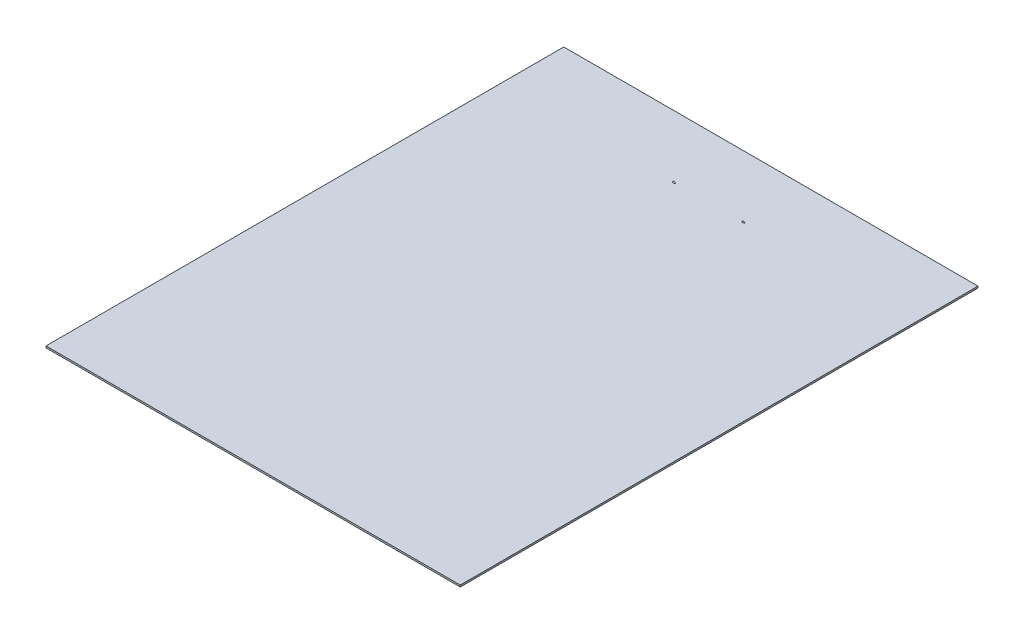
ISO-10303-21;
HEADER;
FILE_DESCRIPTION(('STEP AP214'),'2;1');
FILE_NAME('part.step','',(''),(''),'','','');
FILE_SCHEMA(('AUTOMOTIVE_DESIGN { 1 0 10303 214 1 1 1 1 }'));
ENDSEC;
DATA;
#1=APPLICATION_CONTEXT('core data for automotive mechanical design processes');
#2=APPLICATION_PROTOCOL_DEFINITION('international standard','automotive_design',2000,#1);
#3=PRODUCT_CONTEXT('',#1,'mechanical');
#4=PRODUCT('Part','Part','',(#3));
#5=PRODUCT_RELATED_PRODUCT_CATEGORY('part','',(#4));
#6=PRODUCT_DEFINITION_FORMATION('','',#4);
#7=PRODUCT_DEFINITION_CONTEXT('part definition',#1,'design');
#8=PRODUCT_DEFINITION('design','',#6,#7);
#9=PRODUCT_DEFINITION_SHAPE('','',#8);
#10=(LENGTH_UNIT() NAMED_UNIT(*) SI_UNIT(.MILLI.,.METRE.));
#11=(NAMED_UNIT(*) PLANE_ANGLE_UNIT() SI_UNIT($,.RADIAN.));
#12=(NAMED_UNIT(*) SI_UNIT($,.STERADIAN.) SOLID_ANGLE_UNIT());
#13=UNCERTAINTY_MEASURE_WITH_UNIT(LENGTH_MEASURE(1.E-05),#10,'distance_accuracy_value','');
#14=(GEOMETRIC_REPRESENTATION_CONTEXT(3) GLOBAL_UNCERTAINTY_ASSIGNED_CONTEXT((#13)) GLOBAL_UNIT_ASSIGNED_CONTEXT((#10,
#11,#12)) REPRESENTATION_CONTEXT('',''));
#15=CARTESIAN_POINT('',(0.,0.,0.));
#16=DIRECTION('',(0.,0.,1.));
#17=DIRECTION('',(1.,0.,0.));
#18=AXIS2_PLACEMENT_3D('',#15,#16,#17);
#19=CARTESIAN_POINT('',(0.,0.5,0.));
#20=DIRECTION('',(0.,1.,0.));
#21=DIRECTION('',(0.,0.,1.));
#22=AXIS2_PLACEMENT_3D('',#19,#20,#21);
#23=PLANE('',#22);
#24=DIRECTION('',(0.,0.,-1.));
#25=VECTOR('',#24,1.);
#26=CARTESIAN_POINT('',(60.,0.5,-75.));
#27=LINE('',#26,#25);
#28=CARTESIAN_POINT('',(60.,0.5,75.));
#29=VERTEX_POINT('',#28);
#30=CARTESIAN_POINT('',(60.,0.5,-75.));
#31=VERTEX_POINT('',#30);
#32=EDGE_CURVE('E203',#29,#31,#27,.T.);
#33=ORIENTED_EDGE('',*,*,#32,.T.);
#34=DIRECTION('',(-1.,0.,0.));
#35=VECTOR('',#34,1.);
#36=CARTESIAN_POINT('',(-60.,0.5,-75.));
#37=LINE('',#36,#35);
#38=CARTESIAN_POINT('',(-60.,0.5,-75.));
#39=VERTEX_POINT('',#38);
#40=EDGE_CURVE('E206',#31,#39,#37,.T.);
#41=ORIENTED_EDGE('',*,*,#40,.T.);
#42=DIRECTION('',(0.,0.,1.));
#43=VECTOR('',#42,1.);
#44=CARTESIAN_POINT('',(-60.,0.5,-75.));
#45=LINE('',#44,#43);
#46=CARTESIAN_POINT('',(-60.,0.5,75.));
#47=VERTEX_POINT('',#46);
#48=EDGE_CURVE('E209',#39,#47,#45,.T.);
#49=ORIENTED_EDGE('',*,*,#48,.T.);
#50=DIRECTION('',(1.,0.,0.));
#51=VECTOR('',#50,1.);
#52=CARTESIAN_POINT('',(-60.,0.5,75.));
#53=LINE('',#52,#51);
#54=EDGE_CURVE('E211',#47,#29,#53,.T.);
#55=ORIENTED_EDGE('',*,*,#54,.T.);
#56=EDGE_LOOP('',(#33,#41,#49,#55));
#57=FACE_BOUND('',#56,.T.);
#58=CARTESIAN_POINT('',(-10.460975361802,0.5,-56.9749657072999));
#59=CARTESIAN_POINT('',(-10.4469960564302,0.499999999999999,-56.9547853966699));
#60=CARTESIAN_POINT('',(-10.4312210534308,0.5,-56.9360040411659));
#61=CARTESIAN_POINT('',(-10.3968843461404,0.5,-56.9014101155262));
#62=CARTESIAN_POINT('',(-10.3783411094096,0.500000000000001,-56.8855793267481));
#63=CARTESIAN_POINT('',(-10.3095587228234,0.499999999999996,-56.8351615931186));
#64=CARTESIAN_POINT('',(-10.2535816912959,0.49999999999998,-56.808160111834));
#65=CARTESIAN_POINT('',(-10.1657068433425,0.500000000000009,-56.7807565432656));
#66=CARTESIAN_POINT('',(-10.1354799763858,0.500000000000028,-56.7738037008125));
#67=CARTESIAN_POINT('',(-10.0743173035873,0.499999999999972,-56.7642248890738));
#68=CARTESIAN_POINT('',(-10.0433817892298,0.499999999999896,-56.7615971720441));
#69=CARTESIAN_POINT('',(-9.97600383370771,0.499999999999885,-56.7605651015174));
#70=CARTESIAN_POINT('',(-9.93954619677301,0.499999999999976,-56.7629813883405));
#71=CARTESIAN_POINT('',(-9.86754999083501,0.500000000000024,-56.7737559004484));
#72=CARTESIAN_POINT('',(-9.83201214477104,0.499999999999982,-56.7821186608645));
#73=CARTESIAN_POINT('',(-9.73988282963522,0.500000000000029,-56.812715791551));
#74=CARTESIAN_POINT('',(-9.6848349095989,0.500000000000224,-56.840458044681));
#75=CARTESIAN_POINT('',(-9.61790887989959,0.499999999999914,-56.8911654210405));
#76=CARTESIAN_POINT('',(-9.60021472466478,0.499999999999764,-56.9066803283989));
#77=CARTESIAN_POINT('',(-9.56740112215454,0.500000000000238,-56.9404074809614));
#78=CARTESIAN_POINT('',(-9.55229867630448,0.500000000000867,-56.9586361737685));
#79=CARTESIAN_POINT('',(-9.53886289045487,0.500000000002345,-56.9781467119231));
#80=B_SPLINE_CURVE_WITH_KNOTS('',3,(#58,#59,#60,#61,#62,#63,#64,#65,#66,#67,#68,#69,#70,#71,#72,
#73,#74,#75,#76,#77,#78,#79),.UNSPECIFIED.,.F.,.F.,(4,2,2,2,2,2,2,2,2,2,4),(0.,
0.0733361284396542,0.146203236250548,0.32862516227278,0.421484741874623,0.514306788537526,
0.623392144644421,0.732560785029745,0.913605776793868,0.983955993558317,1.05475138991327),.UNSPECIFIED.);
#81=CARTESIAN_POINT('',(-10.460975361802,0.5,-56.9749657072999));
#82=VERTEX_POINT('',#81);
#83=CARTESIAN_POINT('',(-9.53886289045423,0.5,-56.9781467119232));
#84=VERTEX_POINT('',#83);
#85=EDGE_CURVE('E191',#82,#84,#80,.T.);
#86=ORIENTED_EDGE('',*,*,#85,.F.);
#87=DIRECTION('',(0.999994049863389,0.,-0.00344967213201496));
#88=VECTOR('',#87,1.);
#89=CARTESIAN_POINT('',(-0.19666827004829,0.5,-57.0103744121163));
#90=LINE('',#89,#88);
#91=EDGE_CURVE('E199',#82,#84,#90,.T.);
#92=ORIENTED_EDGE('',*,*,#91,.T.);
#93=EDGE_LOOP('',(#86,#92));
#94=FACE_BOUND('',#93,.T.);
#95=CARTESIAN_POINT('',(9.53533638430643,0.5,-57.043946837035));
#96=CARTESIAN_POINT('',(9.54899701388712,0.499999999999997,-57.0236065895948));
#97=CARTESIAN_POINT('',(9.56448871434286,0.499999999999999,-57.0046524420506));
#98=CARTESIAN_POINT('',(9.59831335376148,0.500000000000002,-56.9697016104425));
#99=CARTESIAN_POINT('',(9.61662673032592,0.500000000000003,-56.9536861124682));
#100=CARTESIAN_POINT('',(9.68439397182631,0.499999999999994,-56.9028176801136));
#101=CARTESIAN_POINT('',(9.7396156890533,0.499999999999962,-56.8754208475064));
#102=CARTESIAN_POINT('',(9.82647679590136,0.500000000000017,-56.8472225943228));
#103=CARTESIAN_POINT('',(9.856392792651,0.500000000000054,-56.83996757891));
#104=CARTESIAN_POINT('',(9.91697496579769,0.499999999999946,-56.8297174266323));
#105=CARTESIAN_POINT('',(9.94764080240037,0.499999999999802,-56.8267203953376));
#106=CARTESIAN_POINT('',(10.0147000793734,0.500000000000072,-56.824797487041));
#107=CARTESIAN_POINT('',(10.05112018358,0.500000000000592,-56.8267118194214));
#108=CARTESIAN_POINT('',(10.1231379622962,0.499999999999407,-56.8364385669432));
#109=CARTESIAN_POINT('',(10.1587348777571,0.499999999997701,-56.8442562181534));
#110=CARTESIAN_POINT('',(10.2519408224626,0.500000000003862,-56.8735614766857));
#111=CARTESIAN_POINT('',(10.3080526008458,0.500000000019033,-56.9007304017142));
#112=CARTESIAN_POINT('',(10.3780785989086,0.499999999992018,-56.9520744888124));
#113=CARTESIAN_POINT('',(10.3975768801854,0.499999999978021,-56.9688283328592));
#114=CARTESIAN_POINT('',(10.4335268620098,0.500000000022152,-57.0055767932845));
#115=CARTESIAN_POINT('',(10.4499533864895,0.500000000080847,-57.025595869593));
#116=CARTESIAN_POINT('',(10.4643493539241,0.500000000219077,-57.0471516463319));
#117=B_SPLINE_CURVE_WITH_KNOTS('',3,(#95,#96,#97,#98,#99,#100,#101,#102,#103,#104,#105,#106,
#107,#108,#109,#110,#111,#112,#113,#114,#115,#116),.UNSPECIFIED.,.F.,.F.,(4,2,2,2,2,2,2,2,2,2,
4),(0.,0.0731886425098684,0.145890986923088,0.326838927721385,0.419004004396445,
0.511128062828486,0.620018443554959,0.729005520432568,0.912126404008055,0.988921203629535,
1.06632019087317),.UNSPECIFIED.);
#118=CARTESIAN_POINT('',(9.53533638430643,0.5,-57.043946837035));
#119=VERTEX_POINT('',#118);
#120=CARTESIAN_POINT('',(10.464349353982,0.5,-57.0471516463424));
#121=VERTEX_POINT('',#120);
#122=EDGE_CURVE('E49',#119,#121,#117,.T.);
#123=ORIENTED_EDGE('',*,*,#122,.F.);
#124=DIRECTION('',(0.999994049863389,0.,-0.00344967213201496));
#125=VECTOR('',#124,1.);
#126=CARTESIAN_POINT('',(-0.19666827004829,0.5,-57.0103744121163));
#127=LINE('',#126,#125);
#128=EDGE_CURVE('E114',#119,#121,#127,.T.);
#129=ORIENTED_EDGE('',*,*,#128,.T.);
#130=EDGE_LOOP('',(#123,#129));
#131=FACE_BOUND('',#130,.T.);
#132=ADVANCED_FACE('F35',(#57,#94,#131),#23,.T.);
#133=CARTESIAN_POINT('',(0.,0.,0.));
#134=DIRECTION('',(0.,1.,0.));
#135=DIRECTION('',(0.,0.,1.));
#136=AXIS2_PLACEMENT_3D('',#133,#134,#135);
#137=PLANE('',#136);
#138=DIRECTION('',(0.999994049863389,0.,-0.00344967213201496));
#139=VECTOR('',#138,1.);
#140=CARTESIAN_POINT('',(-0.196830017791452,0.,-57.0572619928922));
#141=LINE('',#140,#139);
#142=CARTESIAN_POINT('',(-10.4611371095458,0.,-57.0218532880767));
#143=VERTEX_POINT('',#142);
#144=CARTESIAN_POINT('',(-9.53902463819674,0.,-57.0250342926982));
#145=VERTEX_POINT('',#144);
#146=EDGE_CURVE('E153',#143,#145,#141,.T.);
#147=ORIENTED_EDGE('',*,*,#146,.F.);
#148=CARTESIAN_POINT('',(-10.4611371095464,0.,-57.0218532880758));
#149=CARTESIAN_POINT('',(-10.4679630092566,0.,-57.0116813427667));
#150=CARTESIAN_POINT('',(-10.4743320567019,0.,-57.0012082356502));
#151=CARTESIAN_POINT('',(-10.4860684394223,0.,-56.9797007070301));
#152=CARTESIAN_POINT('',(-10.4914346379071,0.,-56.9686656663485));
#153=CARTESIAN_POINT('',(-10.505866608035,0.,-56.9348343559035));
#154=CARTESIAN_POINT('',(-10.5132779087052,0.,-56.9112940911387));
#155=CARTESIAN_POINT('',(-10.5223571457734,0.,-56.8664111386103));
#156=CARTESIAN_POINT('',(-10.5246592139517,0.,-56.8451940493644));
#157=CARTESIAN_POINT('',(-10.5252640777871,0.,-56.802741828253));
#158=CARTESIAN_POINT('',(-10.5235762181254,-3.04750728747226E-13,-56.7815068547539));
#159=CARTESIAN_POINT('',(-10.5166525969999,2.75766327867578E-13,-56.7416590795495));
#160=CARTESIAN_POINT('',(-10.5117590991299,9.86118051421637E-13,-56.7229852973622));
#161=CARTESIAN_POINT('',(-10.4990231552442,-9.87536373846247E-13,-56.6866500841177));
#162=CARTESIAN_POINT('',(-10.491176477913,-3.67642605863797E-12,-56.6689901477437));
#163=CARTESIAN_POINT('',(-10.4725231502204,-3.81624808433177E-12,-56.6343791740182));
#164=CARTESIAN_POINT('',(-10.4616087590495,-1.04891149582623E-12,-56.6174864903724));
#165=CARTESIAN_POINT('',(-10.4374333986551,1.0507752594639E-12,-56.5854600561116));
#166=CARTESIAN_POINT('',(-10.4241682943618,3.77013216371385E-13,-56.5703294841993));
#167=CARTESIAN_POINT('',(-10.3774236651341,-8.61513865742952E-13,-56.5237592980868));
#168=CARTESIAN_POINT('',(-10.3398504035154,-1.76589524780187E-13,-56.4963109334364));
#169=CARTESIAN_POINT('',(-10.2754670173048,1.0595343073926E-13,-56.4607792841041));
#170=CARTESIAN_POINT('',(-10.2503485194683,0.,-56.4493397243013));
#171=CARTESIAN_POINT('',(-10.1987574925318,0.,-56.430045228941));
#172=CARTESIAN_POINT('',(-10.1722840586414,0.,-56.4221927243911));
#173=CARTESIAN_POINT('',(-10.081288902465,0.,-56.4016019040462));
#174=CARTESIAN_POINT('',(-10.0146795070416,0.,-56.3970768960555));
#175=CARTESIAN_POINT('',(-9.9125587365966,0.,-56.4053072731835));
#176=CARTESIAN_POINT('',(-9.87629961169109,0.,-56.4113161694524));
#177=CARTESIAN_POINT('',(-9.80531696869056,0.,-56.4295604466599));
#178=CARTESIAN_POINT('',(-9.77059227187014,0.,-56.4417909545843));
#179=CARTESIAN_POINT('',(-9.71188629956554,0.,-56.4690352658613));
#180=CARTESIAN_POINT('',(-9.68728925225827,0.,-56.4827330360665));
#181=CARTESIAN_POINT('',(-9.64064744839178,0.,-56.513923570098));
#182=CARTESIAN_POINT('',(-9.61859781075366,0.,-56.5314088852949));
#183=CARTESIAN_POINT('',(-9.58170414453953,0.,-56.5665887200221));
#184=CARTESIAN_POINT('',(-9.56627835420516,0.,-56.5836718207093));
#185=CARTESIAN_POINT('',(-9.53846652382989,0.,-56.6201143829363));
#186=CARTESIAN_POINT('',(-9.52607283322025,0.,-56.6394679290629));
#187=CARTESIAN_POINT('',(-9.50486471253764,0.,-56.6802892647052));
#188=CARTESIAN_POINT('',(-9.49608335934021,0.,-56.7017744495549));
#189=CARTESIAN_POINT('',(-9.48288631317772,0.,-56.7460331688076));
#190=CARTESIAN_POINT('',(-9.47846412954489,0.,-56.7688047342095));
#191=CARTESIAN_POINT('',(-9.47457988788737,0.,-56.8117602492291));
#192=CARTESIAN_POINT('',(-9.47454582799799,0.,-56.8318940628244));
#193=CARTESIAN_POINT('',(-9.47800892546718,0.,-56.8718836848981));
#194=CARTESIAN_POINT('',(-9.48151090739355,0.,-56.8917390759712));
#195=CARTESIAN_POINT('',(-9.4920747675098,0.,-56.9314470918564));
#196=CARTESIAN_POINT('',(-9.49929331550529,-2.24284523717531E-13,-56.9512573916819));
#197=CARTESIAN_POINT('',(-9.5168991252813,2.2387015025218E-13,-56.9893779846053));
#198=CARTESIAN_POINT('',(-9.52728050811309,8.35811604364527E-13,-57.0076909813978));
#199=CARTESIAN_POINT('',(-9.53902463819674,2.32894284078417E-12,-57.025034292699));
#200=B_SPLINE_CURVE_WITH_KNOTS('',3,(#148,#149,#150,#151,#152,#153,#154,#155,#156,#157,#158,
#159,#160,#161,#162,#163,#164,#165,#166,#167,#168,#169,#170,#171,#172,#173,#174,#175,#176,#177,
#178,#179,#180,#181,#182,#183,#184,#185,#186,#187,#188,#189,#190,#191,#192,#193,#194,#195,#196,
#197,#198,#199),.UNSPECIFIED.,.F.,.F.,(4,2,2,2,2,2,2,2,2,2,2,2,2,2,2,2,2,2,2,2,2,2,2,2,2,4),(0.,
0.0367257779447862,0.0734929375675458,0.146963630605248,0.21063615722487,0.274159706275462,
0.33181323624701,0.389549688637734,0.449642679461832,0.509842446817241,0.647303862187008,
0.729886592828808,0.812525208440051,1.00921209208499,1.11907326412304,1.22884852069758,
1.31300031644363,1.39698809696133,1.46576488959412,1.53436631274748,1.60358261608027,
1.67269570211341,1.73278923322947,1.79296486676936,1.85591461625366,1.91874806388439),.UNSPECIFIED.);
#201=EDGE_CURVE('E163',#143,#145,#200,.T.);
#202=ORIENTED_EDGE('',*,*,#201,.T.);
#203=EDGE_LOOP('',(#147,#202));
#204=FACE_BOUND('',#203,.T.);
#205=DIRECTION('',(0.,0.,-1.));
#206=VECTOR('',#205,1.);
#207=CARTESIAN_POINT('',(60.,0.,-75.));
#208=LINE('',#207,#206);
#209=CARTESIAN_POINT('',(60.,0.,75.));
#210=VERTEX_POINT('',#209);
#211=CARTESIAN_POINT('',(60.,0.,-75.));
#212=VERTEX_POINT('',#211);
#213=EDGE_CURVE('E202',#210,#212,#208,.T.);
#214=ORIENTED_EDGE('',*,*,#213,.F.);
#215=DIRECTION('',(1.,0.,0.));
#216=VECTOR('',#215,1.);
#217=CARTESIAN_POINT('',(-60.,0.,75.));
#218=LINE('',#217,#216);
#219=CARTESIAN_POINT('',(-60.,0.,75.));
#220=VERTEX_POINT('',#219);
#221=EDGE_CURVE('E207',#220,#210,#218,.T.);
#222=ORIENTED_EDGE('',*,*,#221,.F.);
#223=DIRECTION('',(0.,0.,1.));
#224=VECTOR('',#223,1.);
#225=CARTESIAN_POINT('',(-60.,0.,-75.));
#226=LINE('',#225,#224);
#227=CARTESIAN_POINT('',(-60.,0.,-75.));
#228=VERTEX_POINT('',#227);
#229=EDGE_CURVE('E218',#228,#220,#226,.T.);
#230=ORIENTED_EDGE('',*,*,#229,.F.);
#231=DIRECTION('',(-1.,0.,0.));
#232=VECTOR('',#231,1.);
#233=CARTESIAN_POINT('',(-60.,0.,-75.));
#234=LINE('',#233,#232);
#235=EDGE_CURVE('E216',#212,#228,#234,.T.);
#236=ORIENTED_EDGE('',*,*,#235,.F.);
#237=EDGE_LOOP('',(#214,#222,#230,#236));
#238=FACE_BOUND('',#237,.T.);
#239=DIRECTION('',(0.999994049863389,0.,-0.00344967213201496));
#240=VECTOR('',#239,1.);
#241=CARTESIAN_POINT('',(-0.196830017791452,0.,-57.0572619928922));
#242=LINE('',#241,#240);
#243=CARTESIAN_POINT('',(9.54219184089622,0.,-57.0908586250958));
#244=VERTEX_POINT('',#243);
#245=CARTESIAN_POINT('',(10.45717040191,0.,-57.0940150198311));
#246=VERTEX_POINT('',#245);
#247=EDGE_CURVE('E11',#244,#246,#242,.T.);
#248=ORIENTED_EDGE('',*,*,#247,.F.);
#249=CARTESIAN_POINT('',(9.5421918408342,0.,-57.0908586250066));
#250=CARTESIAN_POINT('',(9.53521976189099,0.,-57.0808324765495));
#251=CARTESIAN_POINT('',(9.5286938948135,0.,-57.0705013430354));
#252=CARTESIAN_POINT('',(9.51662301539737,0.,-57.0492662839337));
#253=CARTESIAN_POINT('',(9.51107914883392,0.,-57.0383617082483));
#254=CARTESIAN_POINT('',(9.49607981902655,0.,-57.0048874227463));
#255=CARTESIAN_POINT('',(9.48825170789535,0.,-56.9815502042819));
#256=CARTESIAN_POINT('',(9.47832654749768,0.,-56.9368371795246));
#257=CARTESIAN_POINT('',(9.4756232593903,0.,-56.9155936605481));
#258=CARTESIAN_POINT('',(9.47426106197324,0.,-56.8730187287148));
#259=CARTESIAN_POINT('',(9.47559205219201,-3.36663240316453E-13,-56.8516876686741));
#260=CARTESIAN_POINT('',(9.48187619622062,3.03773176610827E-13,-56.8117460342922));
#261=CARTESIAN_POINT('',(9.48645745337924,1.080465047857E-12,-56.7930752972528));
#262=CARTESIAN_POINT('',(9.49858849811637,-1.08199508071575E-12,-56.7567028264149));
#263=CARTESIAN_POINT('',(9.50614248020637,-4.0264105974428E-12,-56.7390025022501));
#264=CARTESIAN_POINT('',(9.52417650159421,-4.16055144697693E-12,-56.7043693156671));
#265=CARTESIAN_POINT('',(9.53475040376049,-1.14350211943616E-12,-56.6874855890363));
#266=CARTESIAN_POINT('',(9.55825154035463,1.14552433290251E-12,-56.6554313499574));
#267=CARTESIAN_POINT('',(9.57118290343791,4.10869091423968E-13,-56.6402639200254));
#268=CARTESIAN_POINT('',(9.61678923728796,-9.36894828665199E-13,-56.59356772454));
#269=CARTESIAN_POINT('',(9.65356110544857,-1.92537801539615E-13,-56.5659268768216));
#270=CARTESIAN_POINT('',(9.71673650878295,1.15073028406264E-13,-56.5299052271868));
#271=CARTESIAN_POINT('',(9.74142736450859,0.,-56.5182394592991));
#272=CARTESIAN_POINT('',(9.79219428399044,0.,-56.498421531187));
#273=CARTESIAN_POINT('',(9.81827126187661,0.,-56.4902717228108));
#274=CARTESIAN_POINT('',(9.90821957463002,0.,-56.468491963688));
#275=CARTESIAN_POINT('',(9.9742755696401,0.,-56.4629741079852));
#276=CARTESIAN_POINT('',(10.0760713207187,0.,-56.469415040034));
#277=CARTESIAN_POINT('',(10.1124290574241,0.,-56.4747831000128));
#278=CARTESIAN_POINT('',(10.1837387196407,0.,-56.4917144293474));
#279=CARTESIAN_POINT('',(10.2186915846185,0.,-56.5032734819835));
#280=CARTESIAN_POINT('',(10.2782832511849,0.,-56.529458534467));
#281=CARTESIAN_POINT('',(10.3034814025496,0.,-56.5428218738691));
#282=CARTESIAN_POINT('',(10.3513725538509,0.,-56.5734442314307));
#283=CARTESIAN_POINT('',(10.374070334816,0.,-56.590695615653));
#284=CARTESIAN_POINT('',(10.4120702380258,0.,-56.6254752377376));
#285=CARTESIAN_POINT('',(10.4279629589316,0.,-56.6423568116076));
#286=CARTESIAN_POINT('',(10.4567410507109,0.,-56.6784713974216));
#287=CARTESIAN_POINT('',(10.4696341074249,0.,-56.6976982030511));
#288=CARTESIAN_POINT('',(10.4918566507281,0.,-56.738363534593));
#289=CARTESIAN_POINT('',(10.5011526414226,1.90042272354954E-13,-56.7598205948571));
#290=CARTESIAN_POINT('',(10.5153482117254,-1.89845348550699E-13,-56.8041425657219));
#291=CARTESIAN_POINT('',(10.5202523369597,-7.0836354780924E-13,-56.8270059944543));
#292=CARTESIAN_POINT('',(10.5249451826114,6.12060772486644E-13,-56.870100405926));
#293=CARTESIAN_POINT('',(10.5253381676803,2.1404032415714E-12,-56.8902672047046));
#294=CARTESIAN_POINT('',(10.5225499417717,-2.14058872868487E-12,-56.9303549804233));
#295=CARTESIAN_POINT('',(10.5193684210517,-7.95055906179108E-12,-56.950275935909));
#296=CARTESIAN_POINT('',(10.5098654650782,7.5863673247855E-12,-56.9883698590338));
#297=CARTESIAN_POINT('',(10.5036946490101,2.7700600573251E-11,-57.0065810944168));
#298=CARTESIAN_POINT('',(10.4886165000535,-2.76693629671039E-11,-57.0418046046428));
#299=CARTESIAN_POINT('',(10.4797122609469,-1.03045780231468E-10,-57.0588182083791));
#300=CARTESIAN_POINT('',(10.4656614616789,4.07004845888524E-11,-57.0815173674854));
#301=CARTESIAN_POINT('',(10.4615008549911,1.09235791105612E-10,-57.0878287567348));
#302=CARTESIAN_POINT('',(10.45717040191,2.19539575185561E-10,-57.0940150199098));
#303=B_SPLINE_CURVE_WITH_KNOTS('',3,(#249,#250,#251,#252,#253,#254,#255,#256,#257,#258,#259,
#260,#261,#262,#263,#264,#265,#266,#267,#268,#269,#270,#271,#272,#273,#274,#275,#276,#277,#278,
#279,#280,#281,#282,#283,#284,#285,#286,#287,#288,#289,#290,#291,#292,#293,#294,#295,#296,#297,
#298,#299,#300,#301,#302),.UNSPECIFIED.,.F.,.F.,(4,2,2,2,2,2,2,2,2,2,2,2,2,2,2,2,2,2,2,2,2,2,2,
2,2,2,4),(0.,0.0366124918999084,0.0732674249741069,0.146552158368141,0.21043837236265,
0.274164769068186,0.331578030837308,0.389072594798674,0.44859638024537,0.508225429861194,
0.644126843174401,0.725835648645416,0.807599025245562,1.0029337157307,1.11279637774996,
1.22258430667863,1.30783733958194,1.39292441953944,1.46220641097939,1.53130888120002,
1.60104017903196,1.67069922055863,1.73089796053257,1.79110191732282,1.84854612200059,
1.90592554759762,1.92858898867921),.UNSPECIFIED.);
#304=EDGE_CURVE('E43',#244,#246,#303,.T.);
#305=ORIENTED_EDGE('',*,*,#304,.T.);
#306=EDGE_LOOP('',(#248,#305));
#307=FACE_BOUND('',#306,.T.);
#308=ADVANCED_FACE('F155',(#204,#238,#307),#137,.F.);
#309=CARTESIAN_POINT('',(60.,0.5,-75.));
#310=DIRECTION('',(-1.,0.,0.));
#311=DIRECTION('',(0.,0.,1.));
#312=AXIS2_PLACEMENT_3D('',#309,#310,#311);
#313=PLANE('',#312);
#314=ORIENTED_EDGE('',*,*,#213,.T.);
#315=DIRECTION('',(0.,-1.,0.));
#316=VECTOR('',#315,1.);
#317=CARTESIAN_POINT('',(60.,0.5,-75.));
#318=LINE('',#317,#316);
#319=EDGE_CURVE('E171',#31,#212,#318,.T.);
#320=ORIENTED_EDGE('',*,*,#319,.F.);
#321=ORIENTED_EDGE('',*,*,#32,.F.);
#322=DIRECTION('',(0.,-1.,0.));
#323=VECTOR('',#322,1.);
#324=CARTESIAN_POINT('',(60.,0.5,75.));
#325=LINE('',#324,#323);
#326=EDGE_CURVE('E213',#29,#210,#325,.T.);
#327=ORIENTED_EDGE('',*,*,#326,.T.);
#328=EDGE_LOOP('',(#314,#320,#321,#327));
#329=FACE_BOUND('',#328,.T.);
#330=ADVANCED_FACE('F37',(#329),#313,.F.);
#331=CARTESIAN_POINT('',(-60.,0.5,-75.));
#332=DIRECTION('',(0.,0.,1.));
#333=DIRECTION('',(1.,0.,0.));
#334=AXIS2_PLACEMENT_3D('',#331,#332,#333);
#335=PLANE('',#334);
#336=ORIENTED_EDGE('',*,*,#235,.T.);
#337=DIRECTION('',(0.,-1.,0.));
#338=VECTOR('',#337,1.);
#339=CARTESIAN_POINT('',(-60.,0.5,-75.));
#340=LINE('',#339,#338);
#341=EDGE_CURVE('E225',#39,#228,#340,.T.);
#342=ORIENTED_EDGE('',*,*,#341,.F.);
#343=ORIENTED_EDGE('',*,*,#40,.F.);
#344=ORIENTED_EDGE('',*,*,#319,.T.);
#345=EDGE_LOOP('',(#336,#342,#343,#344));
#346=FACE_BOUND('',#345,.T.);
#347=ADVANCED_FACE('F234',(#346),#335,.F.);
#348=CARTESIAN_POINT('',(-60.,0.5,-75.));
#349=DIRECTION('',(1.,0.,0.));
#350=DIRECTION('',(0.,0.,-1.));
#351=AXIS2_PLACEMENT_3D('',#348,#349,#350);
#352=PLANE('',#351);
#353=ORIENTED_EDGE('',*,*,#229,.T.);
#354=DIRECTION('',(0.,-1.,0.));
#355=VECTOR('',#354,1.);
#356=CARTESIAN_POINT('',(-60.,0.5,75.));
#357=LINE('',#356,#355);
#358=EDGE_CURVE('E223',#47,#220,#357,.T.);
#359=ORIENTED_EDGE('',*,*,#358,.F.);
#360=ORIENTED_EDGE('',*,*,#48,.F.);
#361=ORIENTED_EDGE('',*,*,#341,.T.);
#362=EDGE_LOOP('',(#353,#359,#360,#361));
#363=FACE_BOUND('',#362,.T.);
#364=ADVANCED_FACE('F243',(#363),#352,.F.);
#365=CARTESIAN_POINT('',(-60.,0.5,75.));
#366=DIRECTION('',(0.,0.,-1.));
#367=DIRECTION('',(-1.,0.,0.));
#368=AXIS2_PLACEMENT_3D('',#365,#366,#367);
#369=PLANE('',#368);
#370=ORIENTED_EDGE('',*,*,#221,.T.);
#371=ORIENTED_EDGE('',*,*,#326,.F.);
#372=ORIENTED_EDGE('',*,*,#54,.F.);
#373=ORIENTED_EDGE('',*,*,#358,.T.);
#374=EDGE_LOOP('',(#370,#371,#372,#373));
#375=FACE_BOUND('',#374,.T.);
#376=ADVANCED_FACE('F160',(#375),#369,.F.);
#377=CARTESIAN_POINT('',(-10.,-18.7699237443521,20.879567638553));
#378=DIRECTION('',(0.00343460343281728,0.0175802923549972,0.999839555538774));
#379=DIRECTION('',(0.,-0.999845452894978,0.0175803960488805));
#380=AXIS2_PLACEMENT_3D('',#377,#378,#379);
#381=PLANE('',#380);
#382=CARTESIAN_POINT('',(-10.,-18.7699237443521,20.879567638553));
#383=DIRECTION('',(0.00343460343281728,0.0175802923549972,0.999839555538774));
#384=DIRECTION('',(0.,-0.999845452894978,0.0175803960488805));
#385=AXIS2_PLACEMENT_3D('',#382,#383,#384);
#386=CIRCLE('',#385,0.525);
#387=CARTESIAN_POINT('',(-10.,-19.2948426071219,20.8887973464786));
#388=VERTEX_POINT('',#387);
#389=EDGE_CURVE('E200',#388,#388,#386,.T.);
#390=ORIENTED_EDGE('',*,*,#389,.T.);
#391=EDGE_LOOP('',(#390));
#392=FACE_BOUND('',#391,.T.);
#393=ADVANCED_FACE('F183',(#392),#381,.T.);
#394=CARTESIAN_POINT('',(-10.,-0.27270669202616,-57.0490174878087));
#395=CARTESIAN_POINT('',(-10.,-6.52919700300701,-52.4838907564731));
#396=CARTESIAN_POINT('',(-10.,-9.29055291057494,-46.5517933130196));
#397=CARTESIAN_POINT('',(-10.,-11.375606568853,-33.4352052106518));
#398=CARTESIAN_POINT('',(-10.0000000000064,-10.7172489943098,-26.2135290319307));
#399=CARTESIAN_POINT('',(-9.99999999999364,-9.38919693079077,-11.590607142356));
#400=CARTESIAN_POINT('',(-10.,-8.71828656386204,-4.19041574928687));
#401=CARTESIAN_POINT('',(-10.,-10.7147446343535,9.49522018589577));
#402=CARTESIAN_POINT('',(-10.,-13.3746206407744,15.7519688578785));
#403=CARTESIAN_POINT('',(-10.,-19.2948426071219,20.8887973464786));
#404=CARTESIAN_POINT('',(-8.95000619318115,-0.272369980762372,-57.0526080682063));
#405=CARTESIAN_POINT('',(-8.95000619318115,-6.5298186509189,-52.4875712082923));
#406=CARTESIAN_POINT('',(-8.95000619318115,-9.29234066648365,-46.5549954584021));
#407=CARTESIAN_POINT('',(-8.95000619318115,-11.3784206867217,-33.4375569221278));
#408=CARTESIAN_POINT('',(-8.95000619318752,-10.7201788011837,-26.2156318815885));
#409=CARTESIAN_POINT('',(-8.95000619317479,-9.39213852349996,-11.5926934734299));
#410=CARTESIAN_POINT('',(-8.95000619318115,-8.72111701106586,-4.19272607151048));
#411=CARTESIAN_POINT('',(-8.95000619318115,-10.7166979810035,9.49213255622718));
#412=CARTESIAN_POINT('',(-8.95000619318115,-13.3756109145124,15.7483793789088));
#413=CARTESIAN_POINT('',(-8.95000619318115,-19.294906007895,20.8851915702226));
#414=CARTESIAN_POINT('',(-8.95000619318115,0.773043403289937,-56.9545730925888));
#415=CARTESIAN_POINT('',(-8.95000619318115,-5.45823882260292,-52.6685667585118));
#416=CARTESIAN_POINT('',(-8.95000619318115,-8.36002185750103,-47.0755085086254));
#417=CARTESIAN_POINT('',(-8.95000619318115,-10.6937094754928,-34.2568998021203));
#418=CARTESIAN_POINT('',(-8.95000619318752,-10.10792480903,-27.068658127188));
#419=CARTESIAN_POINT('',(-8.95000619317479,-8.78469399336128,-12.449151218606));
#420=CARTESIAN_POINT('',(-8.95000619318115,-8.04845646513279,-5.01682330977948));
#421=CARTESIAN_POINT('',(-8.95000619318115,-9.81772092807639,8.9234070283666));
#422=CARTESIAN_POINT('',(-8.95000619318115,-12.3305182234391,15.4600567980742));
#423=CARTESIAN_POINT('',(-8.95000619318115,-18.2450682823553,20.8667321543713));
#424=CARTESIAN_POINT('',(-10.,0.772706692026143,-56.9509825121912));
#425=CARTESIAN_POINT('',(-10.,-5.45761717465784,-52.6648863067457));
#426=CARTESIAN_POINT('',(-10.,-8.35823410159232,-47.0723063632544));
#427=CARTESIAN_POINT('',(-10.,-10.6908953576241,-34.254548090633));
#428=CARTESIAN_POINT('',(-10.0000000000064,-10.1049950021593,-27.0665552775238));
#429=CARTESIAN_POINT('',(-9.99999999999364,-8.78175240064891,-12.4470648875385));
#430=CARTESIAN_POINT('',(-10.,-8.04562601792896,-5.01451298756192));
#431=CARTESIAN_POINT('',(-10.,-9.81576758142636,8.92649465804123));
#432=CARTESIAN_POINT('',(-10.,-12.329527949763,15.4636462770165));
#433=CARTESIAN_POINT('',(-10.,-18.2450048815822,20.8703379306273));
#434=CARTESIAN_POINT('',(-11.0499938068188,0.772369980762352,-56.9473919317937));
#435=CARTESIAN_POINT('',(-11.0499938068188,-5.45699552671276,-52.6612058549796));
#436=CARTESIAN_POINT('',(-11.0499938068188,-8.35644634568362,-47.0691042178833));
#437=CARTESIAN_POINT('',(-11.0499938068188,-10.6880812397554,-34.2521963791456));
#438=CARTESIAN_POINT('',(-11.0499938068252,-10.1020651952886,-27.0644524278596));
#439=CARTESIAN_POINT('',(-11.0499938068125,-8.77881080793654,-12.444978556471));
#440=CARTESIAN_POINT('',(-11.0499938068188,-8.04279557072514,-5.01220266534437));
#441=CARTESIAN_POINT('',(-11.0499938068188,-9.81381423477633,8.92958228771586));
#442=CARTESIAN_POINT('',(-11.0499938068188,-12.3285376760869,15.4672357559587));
#443=CARTESIAN_POINT('',(-11.0499938068188,-18.2449414808092,20.8739437068834));
#444=CARTESIAN_POINT('',(-11.0499938068188,-0.273043403289951,-57.0454269074111));
#445=CARTESIAN_POINT('',(-11.0499938068188,-6.52857535509511,-52.4802103046539));
#446=CARTESIAN_POINT('',(-11.0499938068188,-9.28876515466624,-46.5485911676372));
#447=CARTESIAN_POINT('',(-11.0499938068188,-11.3727924509843,-33.4328534991759));
#448=CARTESIAN_POINT('',(-11.0499938068252,-10.7143191874359,-26.2114261822729));
#449=CARTESIAN_POINT('',(-11.0499938068125,-9.38625533808159,-11.5885208112821));
#450=CARTESIAN_POINT('',(-11.0499938068188,-8.71545611665821,-4.18810542706327));
#451=CARTESIAN_POINT('',(-11.0499938068188,-10.7127912877035,9.49830781556435));
#452=CARTESIAN_POINT('',(-11.0499938068188,-13.3736303670364,15.7555583368483));
#453=CARTESIAN_POINT('',(-11.0499938068188,-19.2947792063489,20.8924031227347));
#454=CARTESIAN_POINT('',(-10.,-0.27270669202616,-57.0490174878087));
#455=CARTESIAN_POINT('',(-10.,-6.52919700300701,-52.4838907564731));
#456=CARTESIAN_POINT('',(-10.,-9.29055291057494,-46.5517933130196));
#457=CARTESIAN_POINT('',(-10.,-11.375606568853,-33.4352052106518));
#458=CARTESIAN_POINT('',(-10.0000000000064,-10.7172489943098,-26.2135290319307));
#459=CARTESIAN_POINT('',(-9.99999999999364,-9.38919693079077,-11.590607142356));
#460=CARTESIAN_POINT('',(-10.,-8.71828656386204,-4.19041574928687));
#461=CARTESIAN_POINT('',(-10.,-10.7147446343535,9.49522018589577));
#462=CARTESIAN_POINT('',(-10.,-13.3746206407744,15.7519688578785));
#463=CARTESIAN_POINT('',(-10.,-19.2948426071219,20.8887973464786));
#464=(BOUNDED_SURFACE() B_SPLINE_SURFACE(3,3,((#394,#395,#396,#397,#398,#399,#400,#401,#402,
#403),(#404,#405,#406,#407,#408,#409,#410,#411,#412,#413),(#414,#415,#416,#417,#418,#419,#420,
#421,#422,#423),(#424,#425,#426,#427,#428,#429,#430,#431,#432,#433),(#434,#435,#436,#437,#438,
#439,#440,#441,#442,#443),(#444,#445,#446,#447,#448,#449,#450,#451,#452,#453),(#454,#455,#456,
#457,#458,#459,#460,#461,#462,#463)),.UNSPECIFIED.,.T.,.F.,.F.) B_SPLINE_SURFACE_WITH_KNOTS((4,
3,4),(4,2,2,2,4),(0.,0.5,1.),(0.,0.25,0.5,0.75,1.),
.UNSPECIFIED.) GEOMETRIC_REPRESENTATION_ITEM() RATIONAL_B_SPLINE_SURFACE(((1.,1.,1.,1.,1.,1.,1.,
1.,1.,1.),(0.333333333333333,0.333333333333333,0.333333333333333,0.333333333333333,
0.333333333333333,0.333333333333333,0.333333333333333,0.333333333333333,0.333333333333333,
0.333333333333333),(0.333333333333333,0.333333333333333,0.333333333333333,0.333333333333333,
0.333333333333333,0.333333333333333,0.333333333333333,0.333333333333333,0.333333333333333,
0.333333333333333),(1.,1.,1.,1.,1.,1.,1.,1.,1.,1.),(0.333333333333333,0.333333333333333,
0.333333333333333,0.333333333333333,0.333333333333333,0.333333333333333,0.333333333333333,
0.333333333333333,0.333333333333333,0.333333333333333),(0.333333333333333,0.333333333333333,
0.333333333333333,0.333333333333333,0.333333333333333,0.333333333333333,0.333333333333333,
0.333333333333333,0.333333333333333,0.333333333333333),(1.,1.,1.,1.,1.,1.,1.,1.,1.,1.))) REPRESENTATION_ITEM('') SURFACE());
#465=CARTESIAN_POINT('',(-10.,0.24999999999999,-57.));
#466=DIRECTION('',(0.00343460343281728,-0.0933660927437403,0.995625921832606));
#467=DIRECTION('',(0.,-0.995631794335525,-0.0933666434452036));
#468=AXIS2_PLACEMENT_3D('',#465,#466,#467);
#469=CIRCLE('',#468,0.525);
#470=CARTESIAN_POINT('',(-10.,-0.272706692026161,-57.0490174878087));
#471=VERTEX_POINT('',#470);
#472=EDGE_CURVE('E255',#143,#471,#469,.T.);
#473=EDGE_CURVE('E254',#471,#145,#469,.T.);
#474=ORIENTED_EDGE('',*,*,#389,.F.);
#475=EDGE_LOOP('',(#474));
#476=FACE_BOUND('',#475,.T.);
#477=ORIENTED_EDGE('',*,*,#201,.F.);
#478=ORIENTED_EDGE('',*,*,#472,.T.);
#479=ORIENTED_EDGE('',*,*,#473,.T.);
#480=EDGE_LOOP('',(#477,#478,#479));
#481=FACE_BOUND('',#480,.T.);
#482=ADVANCED_FACE('F181',(#476,#481),#464,.T.);
#483=CARTESIAN_POINT('',(-10.,0.24999999999999,-57.));
#484=DIRECTION('',(0.00343460343281728,-0.0933660927437403,0.995625921832606));
#485=DIRECTION('',(0.,-0.995631794335525,-0.0933666434452036));
#486=AXIS2_PLACEMENT_3D('',#483,#484,#485);
#487=PLANE('',#486);
#488=ORIENTED_EDGE('',*,*,#472,.F.);
#489=ORIENTED_EDGE('',*,*,#146,.T.);
#490=ORIENTED_EDGE('',*,*,#473,.F.);
#491=EDGE_LOOP('',(#488,#489,#490));
#492=FACE_BOUND('',#491,.T.);
#493=ADVANCED_FACE('F182',(#492),#487,.F.);
#494=ORIENTED_EDGE('',*,*,#91,.F.);
#495=EDGE_CURVE('E253',#84,#82,#469,.T.);
#496=ORIENTED_EDGE('',*,*,#495,.F.);
#497=EDGE_LOOP('',(#494,#496));
#498=FACE_BOUND('',#497,.T.);
#499=ADVANCED_FACE('F179',(#498),#487,.F.);
#500=ORIENTED_EDGE('',*,*,#495,.T.);
#501=ORIENTED_EDGE('',*,*,#85,.T.);
#502=EDGE_LOOP('',(#500,#501));
#503=FACE_BOUND('',#502,.T.);
#504=ADVANCED_FACE('F173',(#503),#464,.T.);
#505=CARTESIAN_POINT('',(9.99976406998519,-18.7711313710015,20.8108865911586));
#506=DIRECTION('',(0.00343460343281728,0.0175802923549972,0.999839555538774));
#507=DIRECTION('',(0.,-0.999845452894978,0.0175803960488805));
#508=AXIS2_PLACEMENT_3D('',#505,#506,#507);
#509=PLANE('',#508);
#510=CARTESIAN_POINT('',(9.99976406998519,-18.7711313710015,20.8108865911586));
#511=DIRECTION('',(0.00343460343281728,0.0175802923549972,0.999839555538774));
#512=DIRECTION('',(0.,-0.999845452894978,0.0175803960488805));
#513=AXIS2_PLACEMENT_3D('',#510,#511,#512);
#514=CIRCLE('',#513,0.524999999999999);
#515=CARTESIAN_POINT('',(9.99976406998519,-19.2960502337714,20.8201162990842));
#516=VERTEX_POINT('',#515);
#517=EDGE_CURVE('E110',#516,#516,#514,.T.);
#518=ORIENTED_EDGE('',*,*,#517,.T.);
#519=EDGE_LOOP('',(#518));
#520=FACE_BOUND('',#519,.T.);
#521=ADVANCED_FACE('F111',(#520),#509,.T.);
#522=CARTESIAN_POINT('',(9.99976406998519,-0.266293181973229,-57.1174090919873));
#523=CARTESIAN_POINT('',(9.99976406998519,-6.54103784622908,-52.553994185989));
#524=CARTESIAN_POINT('',(9.99976406998519,-9.32460520323326,-46.6127861986333));
#525=CARTESIAN_POINT('',(9.99976406998519,-11.4292084978007,-33.4799994507572));
#526=CARTESIAN_POINT('',(9.99976406997882,-10.7730545103002,-26.253583075001));
#527=CARTESIAN_POINT('',(9.99976406999155,-9.44522693769513,-11.6303465473383));
#528=CARTESIAN_POINT('',(9.99976406998519,-8.77219952593214,-4.23442162725688));
#529=CARTESIAN_POINT('',(9.99976406998519,-10.7519510177645,9.43640853903483));
#530=CARTESIAN_POINT('',(9.99976406998519,-13.3934828862216,15.6835982336066));
#531=CARTESIAN_POINT('',(9.99976406998519,-19.2960502337714,20.8201162990842));
#532=CARTESIAN_POINT('',(11.049757876804,-0.265956470709438,-57.1209996723848));
#533=CARTESIAN_POINT('',(11.049757876804,-6.54165949415425,-52.5576746376622));
#534=CARTESIAN_POINT('',(11.049757876804,-9.32639295914196,-46.6159883440044));
#535=CARTESIAN_POINT('',(11.049757876804,-11.4320226156694,-33.4823511622446));
#536=CARTESIAN_POINT('',(11.0497578767977,-10.7759843171709,-26.2556859246715));
#537=CARTESIAN_POINT('',(11.0497578768104,-9.4481685304075,-11.6324328783994));
#538=CARTESIAN_POINT('',(11.049757876804,-8.77502997313597,-4.23673194948049));
#539=CARTESIAN_POINT('',(11.049757876804,-10.7539043644145,9.43332090936624));
#540=CARTESIAN_POINT('',(11.049757876804,-13.3944731599527,15.680008754685));
#541=CARTESIAN_POINT('',(11.049757876804,-19.2961136345444,20.8165105228282));
#542=CARTESIAN_POINT('',(11.049757876804,0.779456913342857,-57.0229646967674));
#543=CARTESIAN_POINT('',(11.049757876804,-5.47007966581173,-52.7386701880277));
#544=CARTESIAN_POINT('',(11.049757876804,-8.39407415015935,-47.1365013942391));
#545=CARTESIAN_POINT('',(11.049757876804,-10.7473114044405,-34.3016940422257));
#546=CARTESIAN_POINT('',(11.0497578767977,-10.1637303250459,-27.10871217022));
#547=CARTESIAN_POINT('',(11.0497578768104,-8.84072400024017,-12.4888906236264));
#548=CARTESIAN_POINT('',(11.049757876804,-8.10236942720894,-5.06082918775553));
#549=CARTESIAN_POINT('',(11.049757876804,-9.85492731148134,8.86459538151171));
#550=CARTESIAN_POINT('',(11.049757876804,-12.3493804689276,15.3916861738642));
#551=CARTESIAN_POINT('',(11.049757876804,-18.2462759090047,20.7980511069769));
#552=CARTESIAN_POINT('',(9.99976406998519,0.779120202079067,-57.0193741163698));
#553=CARTESIAN_POINT('',(9.99976406998519,-5.46945801787992,-52.7349897362085));
#554=CARTESIAN_POINT('',(9.99976406998519,-8.39228639425064,-47.1332992488452));
#555=CARTESIAN_POINT('',(9.99976406998519,-10.7444972865718,-34.2993423307611));
#556=CARTESIAN_POINT('',(9.99976406997882,-10.1608005181688,-27.1066093205559));
#557=CARTESIAN_POINT('',(9.99976406999155,-8.83778240753417,-12.4868042925589));
#558=CARTESIAN_POINT('',(9.99976406998519,-8.09953898000512,-5.05851886553193));
#559=CARTESIAN_POINT('',(9.99976406998519,-9.85297396483131,8.8676830111803));
#560=CARTESIAN_POINT('',(9.99976406998519,-12.3483901952102,15.3952756528133));
#561=CARTESIAN_POINT('',(9.99976406998519,-18.2462125082317,20.8016568832329));
#562=CARTESIAN_POINT('',(8.94977026316634,0.778783490815279,-57.0157835359722));
#563=CARTESIAN_POINT('',(8.94977026316634,-5.46883636994811,-52.7313092843893));
#564=CARTESIAN_POINT('',(8.94977026316634,-8.39049863834194,-47.1300971034514));
#565=CARTESIAN_POINT('',(8.94977026316634,-10.7416831687031,-34.2969906192966));
#566=CARTESIAN_POINT('',(8.94977026315997,-10.1578707112918,-27.1045064708917));
#567=CARTESIAN_POINT('',(8.94977026317271,-8.83484081482816,-12.4847179614914));
#568=CARTESIAN_POINT('',(8.94977026316634,-8.09670853280129,-5.05620854330833));
#569=CARTESIAN_POINT('',(8.94977026316634,-9.85102061818128,8.87077064084888));
#570=CARTESIAN_POINT('',(8.94977026316634,-12.3473999214929,15.3988651317624));
#571=CARTESIAN_POINT('',(8.94977026316634,-18.2461491074586,20.805262659489));
#572=CARTESIAN_POINT('',(8.94977026316634,-0.26662989323702,-57.1138185115897));
#573=CARTESIAN_POINT('',(8.94977026316634,-6.5404161983039,-52.5503137343158));
#574=CARTESIAN_POINT('',(8.94977026316634,-9.32281744732455,-46.6095840532623));
#575=CARTESIAN_POINT('',(8.94977026316634,-11.426394379932,-33.4776477392699));
#576=CARTESIAN_POINT('',(8.94977026315997,-10.7701247034295,-26.2514802253305));
#577=CARTESIAN_POINT('',(8.94977026317271,-9.44228534498276,-11.6282602162771));
#578=CARTESIAN_POINT('',(8.94977026316634,-8.76936907872832,-4.23211130503328));
#579=CARTESIAN_POINT('',(8.94977026316634,-10.7499976711145,9.43949616870341));
#580=CARTESIAN_POINT('',(8.94977026316634,-13.3924926124905,15.6871877125282));
#581=CARTESIAN_POINT('',(8.94977026316634,-19.2959868329983,20.8237220753403));
#582=CARTESIAN_POINT('',(9.99976406998519,-0.266293181973229,-57.1174090919873));
#583=CARTESIAN_POINT('',(9.99976406998519,-6.54103784622908,-52.553994185989));
#584=CARTESIAN_POINT('',(9.99976406998519,-9.32460520323326,-46.6127861986333));
#585=CARTESIAN_POINT('',(9.99976406998519,-11.4292084978007,-33.4799994507572));
#586=CARTESIAN_POINT('',(9.99976406997882,-10.7730545103002,-26.253583075001));
#587=CARTESIAN_POINT('',(9.99976406999155,-9.44522693769513,-11.6303465473383));
#588=CARTESIAN_POINT('',(9.99976406998519,-8.77219952593214,-4.23442162725688));
#589=CARTESIAN_POINT('',(9.99976406998519,-10.7519510177645,9.43640853903483));
#590=CARTESIAN_POINT('',(9.99976406998519,-13.3934828862216,15.6835982336066));
#591=CARTESIAN_POINT('',(9.99976406998519,-19.2960502337714,20.8201162990842));
#592=(BOUNDED_SURFACE() B_SPLINE_SURFACE(3,3,((#522,#523,#524,#525,#526,#527,#528,#529,#530,
#531),(#532,#533,#534,#535,#536,#537,#538,#539,#540,#541),(#542,#543,#544,#545,#546,#547,#548,
#549,#550,#551),(#552,#553,#554,#555,#556,#557,#558,#559,#560,#561),(#562,#563,#564,#565,#566,
#567,#568,#569,#570,#571),(#572,#573,#574,#575,#576,#577,#578,#579,#580,#581),(#582,#583,#584,
#585,#586,#587,#588,#589,#590,#591)),.UNSPECIFIED.,.T.,.F.,.F.) B_SPLINE_SURFACE_WITH_KNOTS((4,
3,4),(4,2,2,2,4),(0.,0.5,1.),(0.,0.25,0.5,0.75,1.),
.UNSPECIFIED.) GEOMETRIC_REPRESENTATION_ITEM() RATIONAL_B_SPLINE_SURFACE(((1.,1.,1.,1.,1.,1.,1.,
1.,1.,1.),(0.333333333333333,0.333333333333333,0.333333333333333,0.333333333333333,
0.333333333333333,0.333333333333333,0.333333333333333,0.333333333333333,0.333333333333333,
0.333333333333333),(0.333333333333333,0.333333333333333,0.333333333333333,0.333333333333333,
0.333333333333333,0.333333333333333,0.333333333333333,0.333333333333333,0.333333333333333,
0.333333333333333),(1.,1.,1.,1.,1.,1.,1.,1.,1.,1.),(0.333333333333333,0.333333333333333,
0.333333333333333,0.333333333333333,0.333333333333333,0.333333333333333,0.333333333333333,
0.333333333333333,0.333333333333333,0.333333333333333),(0.333333333333333,0.333333333333333,
0.333333333333333,0.333333333333333,0.333333333333333,0.333333333333333,0.333333333333333,
0.333333333333333,0.333333333333333,0.333333333333333),(1.,1.,1.,1.,1.,1.,1.,1.,1.,1.))) REPRESENTATION_ITEM('') SURFACE());
#593=CARTESIAN_POINT('',(9.99976406998519,0.256413510052921,-57.0683916041785));
#594=DIRECTION('',(0.00343460343281728,-0.0933660927437403,0.995625921832606));
#595=DIRECTION('',(0.,-0.995631794335525,-0.0933666434452036));
#596=AXIS2_PLACEMENT_3D('',#593,#594,#595);
#597=CIRCLE('',#596,0.524999999999999);
#598=CARTESIAN_POINT('',(9.99976406998519,-0.266293181973229,-57.1174090919873));
#599=VERTEX_POINT('',#598);
#600=EDGE_CURVE('E118',#244,#599,#597,.T.);
#601=EDGE_CURVE('E57',#599,#246,#597,.T.);
#602=ORIENTED_EDGE('',*,*,#517,.F.);
#603=EDGE_LOOP('',(#602));
#604=FACE_BOUND('',#603,.T.);
#605=ORIENTED_EDGE('',*,*,#304,.F.);
#606=ORIENTED_EDGE('',*,*,#600,.T.);
#607=ORIENTED_EDGE('',*,*,#601,.T.);
#608=EDGE_LOOP('',(#605,#606,#607));
#609=FACE_BOUND('',#608,.T.);
#610=ADVANCED_FACE('F138',(#604,#609),#592,.T.);
#611=CARTESIAN_POINT('',(9.99976406998519,0.256413510052921,-57.0683916041785));
#612=DIRECTION('',(0.00343460343281728,-0.0933660927437403,0.995625921832606));
#613=DIRECTION('',(0.,-0.995631794335525,-0.0933666434452036));
#614=AXIS2_PLACEMENT_3D('',#611,#612,#613);
#615=PLANE('',#614);
#616=ORIENTED_EDGE('',*,*,#600,.F.);
#617=ORIENTED_EDGE('',*,*,#247,.T.);
#618=ORIENTED_EDGE('',*,*,#601,.F.);
#619=EDGE_LOOP('',(#616,#617,#618));
#620=FACE_BOUND('',#619,.T.);
#621=ADVANCED_FACE('F139',(#620),#615,.F.);
#622=ORIENTED_EDGE('',*,*,#128,.F.);
#623=EDGE_CURVE('E116',#121,#119,#597,.T.);
#624=ORIENTED_EDGE('',*,*,#623,.F.);
#625=EDGE_LOOP('',(#622,#624));
#626=FACE_BOUND('',#625,.T.);
#627=ADVANCED_FACE('F136',(#626),#615,.F.);
#628=ORIENTED_EDGE('',*,*,#623,.T.);
#629=ORIENTED_EDGE('',*,*,#122,.T.);
#630=EDGE_LOOP('',(#628,#629));
#631=FACE_BOUND('',#630,.T.);
#632=ADVANCED_FACE('F130',(#631),#592,.T.);
#633=CLOSED_SHELL('',(#132,#308,#330,#347,#364,#376,#393,#482,#493,#499,#504,#521,#610,#621,
#627,#632));
#634=MANIFOLD_SOLID_BREP('B2',#633);
#635=ADVANCED_BREP_SHAPE_REPRESENTATION('',(#18,#634),#14);
#636=SHAPE_DEFINITION_REPRESENTATION(#9,#635);
ENDSEC;
END-ISO-10303-21;
